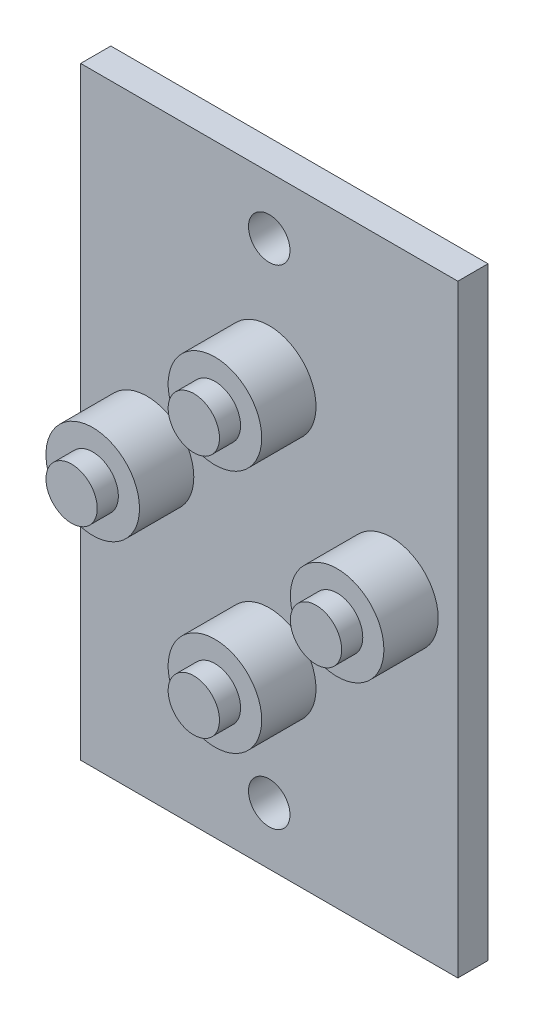
ISO-10303-21;
HEADER;
FILE_DESCRIPTION(('STEP AP214'),'2;1');
FILE_NAME('part.step','',(''),(''),'','','');
FILE_SCHEMA(('AUTOMOTIVE_DESIGN { 1 0 10303 214 1 1 1 1 }'));
ENDSEC;
DATA;
#1=APPLICATION_CONTEXT('core data for automotive mechanical design processes');
#2=APPLICATION_PROTOCOL_DEFINITION('international standard','automotive_design',2000,#1);
#3=PRODUCT_CONTEXT('',#1,'mechanical');
#4=PRODUCT('Part','Part','',(#3));
#5=PRODUCT_RELATED_PRODUCT_CATEGORY('part','',(#4));
#6=PRODUCT_DEFINITION_FORMATION('','',#4);
#7=PRODUCT_DEFINITION_CONTEXT('part definition',#1,'design');
#8=PRODUCT_DEFINITION('design','',#6,#7);
#9=PRODUCT_DEFINITION_SHAPE('','',#8);
#10=(LENGTH_UNIT() NAMED_UNIT(*) SI_UNIT(.MILLI.,.METRE.));
#11=(NAMED_UNIT(*) PLANE_ANGLE_UNIT() SI_UNIT($,.RADIAN.));
#12=(NAMED_UNIT(*) SI_UNIT($,.STERADIAN.) SOLID_ANGLE_UNIT());
#13=UNCERTAINTY_MEASURE_WITH_UNIT(LENGTH_MEASURE(1.E-05),#10,'distance_accuracy_value','');
#14=(GEOMETRIC_REPRESENTATION_CONTEXT(3) GLOBAL_UNCERTAINTY_ASSIGNED_CONTEXT((#13)) GLOBAL_UNIT_ASSIGNED_CONTEXT((#10,
#11,#12)) REPRESENTATION_CONTEXT('',''));
#15=CARTESIAN_POINT('',(0.,0.,0.));
#16=DIRECTION('',(0.,0.,1.));
#17=DIRECTION('',(1.,0.,0.));
#18=AXIS2_PLACEMENT_3D('',#15,#16,#17);
#19=CARTESIAN_POINT('',(12.5,20.,2.));
#20=DIRECTION('',(-1.,0.,0.));
#21=DIRECTION('',(0.,-1.,0.));
#22=AXIS2_PLACEMENT_3D('',#19,#20,#21);
#23=PLANE('',#22);
#24=DIRECTION('',(0.,1.,0.));
#25=VECTOR('',#24,1.);
#26=CARTESIAN_POINT('',(12.5,20.,0.));
#27=LINE('',#26,#25);
#28=CARTESIAN_POINT('',(12.5,-20.,0.));
#29=VERTEX_POINT('',#28);
#30=CARTESIAN_POINT('',(12.5,20.,0.));
#31=VERTEX_POINT('',#30);
#32=EDGE_CURVE('E98',#29,#31,#27,.T.);
#33=ORIENTED_EDGE('',*,*,#32,.T.);
#34=DIRECTION('',(0.,0.,-1.));
#35=VECTOR('',#34,1.);
#36=CARTESIAN_POINT('',(12.5,20.,2.));
#37=LINE('',#36,#35);
#38=CARTESIAN_POINT('',(12.5,20.,2.));
#39=VERTEX_POINT('',#38);
#40=EDGE_CURVE('E11',#39,#31,#37,.T.);
#41=ORIENTED_EDGE('',*,*,#40,.F.);
#42=DIRECTION('',(0.,1.,0.));
#43=VECTOR('',#42,1.);
#44=CARTESIAN_POINT('',(12.5,20.,2.));
#45=LINE('',#44,#43);
#46=CARTESIAN_POINT('',(12.5,-20.,2.));
#47=VERTEX_POINT('',#46);
#48=EDGE_CURVE('E85',#47,#39,#45,.T.);
#49=ORIENTED_EDGE('',*,*,#48,.F.);
#50=DIRECTION('',(0.,0.,-1.));
#51=VECTOR('',#50,1.);
#52=CARTESIAN_POINT('',(12.5,-20.,2.));
#53=LINE('',#52,#51);
#54=EDGE_CURVE('E94',#47,#29,#53,.T.);
#55=ORIENTED_EDGE('',*,*,#54,.T.);
#56=EDGE_LOOP('',(#33,#41,#49,#55));
#57=FACE_BOUND('',#56,.T.);
#58=ADVANCED_FACE('F32',(#57),#23,.F.);
#59=CARTESIAN_POINT('',(-12.5,20.,2.));
#60=DIRECTION('',(0.,-1.,0.));
#61=DIRECTION('',(0.,0.,-1.));
#62=AXIS2_PLACEMENT_3D('',#59,#60,#61);
#63=PLANE('',#62);
#64=DIRECTION('',(-1.,0.,0.));
#65=VECTOR('',#64,1.);
#66=CARTESIAN_POINT('',(-12.5,20.,0.));
#67=LINE('',#66,#65);
#68=CARTESIAN_POINT('',(-12.5,20.,0.));
#69=VERTEX_POINT('',#68);
#70=EDGE_CURVE('E89',#31,#69,#67,.T.);
#71=ORIENTED_EDGE('',*,*,#70,.T.);
#72=DIRECTION('',(0.,0.,-1.));
#73=VECTOR('',#72,1.);
#74=CARTESIAN_POINT('',(-12.5,20.,2.));
#75=LINE('',#74,#73);
#76=CARTESIAN_POINT('',(-12.5,20.,2.));
#77=VERTEX_POINT('',#76);
#78=EDGE_CURVE('E41',#77,#69,#75,.T.);
#79=ORIENTED_EDGE('',*,*,#78,.F.);
#80=DIRECTION('',(-1.,0.,0.));
#81=VECTOR('',#80,1.);
#82=CARTESIAN_POINT('',(-12.5,20.,2.));
#83=LINE('',#82,#81);
#84=EDGE_CURVE('E80',#39,#77,#83,.T.);
#85=ORIENTED_EDGE('',*,*,#84,.F.);
#86=ORIENTED_EDGE('',*,*,#40,.T.);
#87=EDGE_LOOP('',(#71,#79,#85,#86));
#88=FACE_BOUND('',#87,.T.);
#89=ADVANCED_FACE('F88',(#88),#63,.F.);
#90=CARTESIAN_POINT('',(-12.5,20.,2.));
#91=DIRECTION('',(1.,0.,0.));
#92=DIRECTION('',(0.,1.,0.));
#93=AXIS2_PLACEMENT_3D('',#90,#91,#92);
#94=PLANE('',#93);
#95=DIRECTION('',(0.,-1.,0.));
#96=VECTOR('',#95,1.);
#97=CARTESIAN_POINT('',(-12.5,20.,0.));
#98=LINE('',#97,#96);
#99=CARTESIAN_POINT('',(-12.5,-20.,0.));
#100=VERTEX_POINT('',#99);
#101=EDGE_CURVE('E67',#69,#100,#98,.T.);
#102=ORIENTED_EDGE('',*,*,#101,.T.);
#103=DIRECTION('',(0.,0.,-1.));
#104=VECTOR('',#103,1.);
#105=CARTESIAN_POINT('',(-12.5,-20.,2.));
#106=LINE('',#105,#104);
#107=CARTESIAN_POINT('',(-12.5,-20.,2.));
#108=VERTEX_POINT('',#107);
#109=EDGE_CURVE('E90',#108,#100,#106,.T.);
#110=ORIENTED_EDGE('',*,*,#109,.F.);
#111=DIRECTION('',(0.,-1.,0.));
#112=VECTOR('',#111,1.);
#113=CARTESIAN_POINT('',(-12.5,20.,2.));
#114=LINE('',#113,#112);
#115=EDGE_CURVE('E83',#77,#108,#114,.T.);
#116=ORIENTED_EDGE('',*,*,#115,.F.);
#117=ORIENTED_EDGE('',*,*,#78,.T.);
#118=EDGE_LOOP('',(#102,#110,#116,#117));
#119=FACE_BOUND('',#118,.T.);
#120=ADVANCED_FACE('F92',(#119),#94,.F.);
#121=CARTESIAN_POINT('',(-12.5,-20.,2.));
#122=DIRECTION('',(0.,1.,0.));
#123=DIRECTION('',(0.,0.,1.));
#124=AXIS2_PLACEMENT_3D('',#121,#122,#123);
#125=PLANE('',#124);
#126=DIRECTION('',(1.,0.,0.));
#127=VECTOR('',#126,1.);
#128=CARTESIAN_POINT('',(-12.5,-20.,0.));
#129=LINE('',#128,#127);
#130=EDGE_CURVE('E73',#100,#29,#129,.T.);
#131=ORIENTED_EDGE('',*,*,#130,.T.);
#132=ORIENTED_EDGE('',*,*,#54,.F.);
#133=DIRECTION('',(1.,0.,0.));
#134=VECTOR('',#133,1.);
#135=CARTESIAN_POINT('',(-12.5,-20.,2.));
#136=LINE('',#135,#134);
#137=EDGE_CURVE('E50',#108,#47,#136,.T.);
#138=ORIENTED_EDGE('',*,*,#137,.F.);
#139=ORIENTED_EDGE('',*,*,#109,.T.);
#140=EDGE_LOOP('',(#131,#132,#138,#139));
#141=FACE_BOUND('',#140,.T.);
#142=ADVANCED_FACE('F171',(#141),#125,.F.);
#143=CARTESIAN_POINT('',(0.,0.,2.));
#144=DIRECTION('',(0.,0.,1.));
#145=DIRECTION('',(1.,0.,0.));
#146=AXIS2_PLACEMENT_3D('',#143,#144,#145);
#147=PLANE('',#146);
#148=CARTESIAN_POINT('',(0.,-16.2,2.));
#149=DIRECTION('',(0.,0.,1.));
#150=DIRECTION('',(1.,0.,0.));
#151=AXIS2_PLACEMENT_3D('',#148,#149,#150);
#152=CIRCLE('',#151,1.375);
#153=CARTESIAN_POINT('',(1.375,-16.2,2.));
#154=VERTEX_POINT('',#153);
#155=EDGE_CURVE('E120',#154,#154,#152,.T.);
#156=ORIENTED_EDGE('',*,*,#155,.F.);
#157=EDGE_LOOP('',(#156));
#158=FACE_BOUND('',#157,.T.);
#159=CARTESIAN_POINT('',(0.,16.2,2.));
#160=DIRECTION('',(0.,0.,1.));
#161=DIRECTION('',(1.,0.,0.));
#162=AXIS2_PLACEMENT_3D('',#159,#160,#161);
#163=CIRCLE('',#162,1.375);
#164=CARTESIAN_POINT('',(1.375,16.2,2.));
#165=VERTEX_POINT('',#164);
#166=EDGE_CURVE('E109',#165,#165,#163,.T.);
#167=ORIENTED_EDGE('',*,*,#166,.F.);
#168=EDGE_LOOP('',(#167));
#169=FACE_BOUND('',#168,.T.);
#170=CARTESIAN_POINT('',(0.,-8.10000000000001,2.));
#171=DIRECTION('',(0.,0.,1.));
#172=DIRECTION('',(1.,0.,0.));
#173=AXIS2_PLACEMENT_3D('',#170,#171,#172);
#174=CIRCLE('',#173,3.1);
#175=CARTESIAN_POINT('',(3.1,-8.10000000000001,2.));
#176=VERTEX_POINT('',#175);
#177=EDGE_CURVE('E141',#176,#176,#174,.T.);
#178=ORIENTED_EDGE('',*,*,#177,.F.);
#179=EDGE_LOOP('',(#178));
#180=FACE_BOUND('',#179,.T.);
#181=CARTESIAN_POINT('',(0.,8.09999999999999,2.));
#182=DIRECTION('',(0.,0.,1.));
#183=DIRECTION('',(1.,0.,0.));
#184=AXIS2_PLACEMENT_3D('',#181,#182,#183);
#185=CIRCLE('',#184,3.1);
#186=CARTESIAN_POINT('',(3.09999999999999,8.09999999999999,2.));
#187=VERTEX_POINT('',#186);
#188=EDGE_CURVE('E147',#187,#187,#185,.T.);
#189=ORIENTED_EDGE('',*,*,#188,.F.);
#190=EDGE_LOOP('',(#189));
#191=FACE_BOUND('',#190,.T.);
#192=CARTESIAN_POINT('',(8.1,0.,2.));
#193=DIRECTION('',(0.,0.,1.));
#194=DIRECTION('',(1.,0.,0.));
#195=AXIS2_PLACEMENT_3D('',#192,#193,#194);
#196=CIRCLE('',#195,3.1);
#197=CARTESIAN_POINT('',(11.2,0.,2.));
#198=VERTEX_POINT('',#197);
#199=EDGE_CURVE('E153',#198,#198,#196,.T.);
#200=ORIENTED_EDGE('',*,*,#199,.F.);
#201=EDGE_LOOP('',(#200));
#202=FACE_BOUND('',#201,.T.);
#203=CARTESIAN_POINT('',(-8.1,0.,2.));
#204=DIRECTION('',(0.,0.,1.));
#205=DIRECTION('',(1.,0.,0.));
#206=AXIS2_PLACEMENT_3D('',#203,#204,#205);
#207=CIRCLE('',#206,3.1);
#208=CARTESIAN_POINT('',(-5.,0.,2.));
#209=VERTEX_POINT('',#208);
#210=EDGE_CURVE('E159',#209,#209,#207,.T.);
#211=ORIENTED_EDGE('',*,*,#210,.F.);
#212=EDGE_LOOP('',(#211));
#213=FACE_BOUND('',#212,.T.);
#214=ORIENTED_EDGE('',*,*,#48,.T.);
#215=ORIENTED_EDGE('',*,*,#84,.T.);
#216=ORIENTED_EDGE('',*,*,#115,.T.);
#217=ORIENTED_EDGE('',*,*,#137,.T.);
#218=EDGE_LOOP('',(#214,#215,#216,#217));
#219=FACE_BOUND('',#218,.T.);
#220=ADVANCED_FACE('F81',(#158,#169,#180,#191,#202,#213,#219),#147,.T.);
#221=CARTESIAN_POINT('',(0.,0.,0.));
#222=DIRECTION('',(0.,0.,1.));
#223=DIRECTION('',(1.,0.,0.));
#224=AXIS2_PLACEMENT_3D('',#221,#222,#223);
#225=PLANE('',#224);
#226=CARTESIAN_POINT('',(0.,-16.2,0.));
#227=DIRECTION('',(0.,0.,1.));
#228=DIRECTION('',(1.,0.,0.));
#229=AXIS2_PLACEMENT_3D('',#226,#227,#228);
#230=CIRCLE('',#229,1.375);
#231=CARTESIAN_POINT('',(1.375,-16.2,0.));
#232=VERTEX_POINT('',#231);
#233=EDGE_CURVE('E35',#232,#232,#230,.T.);
#234=ORIENTED_EDGE('',*,*,#233,.T.);
#235=EDGE_LOOP('',(#234));
#236=FACE_BOUND('',#235,.T.);
#237=CARTESIAN_POINT('',(0.,16.2,0.));
#238=DIRECTION('',(0.,0.,1.));
#239=DIRECTION('',(1.,0.,0.));
#240=AXIS2_PLACEMENT_3D('',#237,#238,#239);
#241=CIRCLE('',#240,1.375);
#242=CARTESIAN_POINT('',(1.375,16.2,0.));
#243=VERTEX_POINT('',#242);
#244=EDGE_CURVE('E106',#243,#243,#241,.T.);
#245=ORIENTED_EDGE('',*,*,#244,.T.);
#246=EDGE_LOOP('',(#245));
#247=FACE_BOUND('',#246,.T.);
#248=ORIENTED_EDGE('',*,*,#32,.F.);
#249=ORIENTED_EDGE('',*,*,#130,.F.);
#250=ORIENTED_EDGE('',*,*,#101,.F.);
#251=ORIENTED_EDGE('',*,*,#70,.F.);
#252=EDGE_LOOP('',(#248,#249,#250,#251));
#253=FACE_BOUND('',#252,.T.);
#254=ADVANCED_FACE('F170',(#236,#247,#253),#225,.F.);
#255=CARTESIAN_POINT('',(-8.1,0.,5.6));
#256=DIRECTION('',(0.,0.,-1.));
#257=DIRECTION('',(-1.,0.,0.));
#258=AXIS2_PLACEMENT_3D('',#255,#256,#257);
#259=CYLINDRICAL_SURFACE('',#258,3.1);
#260=CARTESIAN_POINT('',(-8.1,0.,5.6));
#261=DIRECTION('',(0.,0.,1.));
#262=DIRECTION('',(1.,0.,0.));
#263=AXIS2_PLACEMENT_3D('',#260,#261,#262);
#264=CIRCLE('',#263,3.1);
#265=CARTESIAN_POINT('',(-5.,0.,5.6));
#266=VERTEX_POINT('',#265);
#267=EDGE_CURVE('E101',#266,#266,#264,.T.);
#268=ORIENTED_EDGE('',*,*,#267,.F.);
#269=EDGE_LOOP('',(#268));
#270=FACE_BOUND('',#269,.T.);
#271=ORIENTED_EDGE('',*,*,#210,.T.);
#272=EDGE_LOOP('',(#271));
#273=FACE_BOUND('',#272,.T.);
#274=ADVANCED_FACE('F167',(#270,#273),#259,.T.);
#275=CARTESIAN_POINT('',(-8.1,0.,5.6));
#276=DIRECTION('',(0.,0.,1.));
#277=DIRECTION('',(1.,0.,0.));
#278=AXIS2_PLACEMENT_3D('',#275,#276,#277);
#279=PLANE('',#278);
#280=CARTESIAN_POINT('',(-8.1,0.,5.6));
#281=DIRECTION('',(0.,0.,1.));
#282=DIRECTION('',(1.,0.,0.));
#283=AXIS2_PLACEMENT_3D('',#280,#281,#282);
#284=CIRCLE('',#283,1.7);
#285=CARTESIAN_POINT('',(-6.4,0.,5.6));
#286=VERTEX_POINT('',#285);
#287=EDGE_CURVE('E129',#286,#286,#284,.T.);
#288=ORIENTED_EDGE('',*,*,#287,.F.);
#289=EDGE_LOOP('',(#288));
#290=FACE_BOUND('',#289,.T.);
#291=ORIENTED_EDGE('',*,*,#267,.T.);
#292=EDGE_LOOP('',(#291));
#293=FACE_BOUND('',#292,.T.);
#294=ADVANCED_FACE('F211',(#290,#293),#279,.T.);
#295=CARTESIAN_POINT('',(8.1,0.,5.6));
#296=DIRECTION('',(0.,0.,-1.));
#297=DIRECTION('',(-1.,0.,0.));
#298=AXIS2_PLACEMENT_3D('',#295,#296,#297);
#299=CYLINDRICAL_SURFACE('',#298,3.1);
#300=CARTESIAN_POINT('',(8.1,0.,5.6));
#301=DIRECTION('',(0.,0.,1.));
#302=DIRECTION('',(1.,0.,0.));
#303=AXIS2_PLACEMENT_3D('',#300,#301,#302);
#304=CIRCLE('',#303,3.1);
#305=CARTESIAN_POINT('',(11.2,0.,5.6));
#306=VERTEX_POINT('',#305);
#307=EDGE_CURVE('E156',#306,#306,#304,.T.);
#308=ORIENTED_EDGE('',*,*,#307,.F.);
#309=EDGE_LOOP('',(#308));
#310=FACE_BOUND('',#309,.T.);
#311=ORIENTED_EDGE('',*,*,#199,.T.);
#312=EDGE_LOOP('',(#311));
#313=FACE_BOUND('',#312,.T.);
#314=ADVANCED_FACE('F219',(#310,#313),#299,.T.);
#315=CARTESIAN_POINT('',(8.1,0.,5.6));
#316=DIRECTION('',(0.,0.,1.));
#317=DIRECTION('',(1.,0.,0.));
#318=AXIS2_PLACEMENT_3D('',#315,#316,#317);
#319=PLANE('',#318);
#320=CARTESIAN_POINT('',(8.1,0.,5.6));
#321=DIRECTION('',(0.,0.,1.));
#322=DIRECTION('',(1.,0.,0.));
#323=AXIS2_PLACEMENT_3D('',#320,#321,#322);
#324=CIRCLE('',#323,1.7);
#325=CARTESIAN_POINT('',(9.8,0.,5.6));
#326=VERTEX_POINT('',#325);
#327=EDGE_CURVE('E124',#326,#326,#324,.T.);
#328=ORIENTED_EDGE('',*,*,#327,.F.);
#329=EDGE_LOOP('',(#328));
#330=FACE_BOUND('',#329,.T.);
#331=ORIENTED_EDGE('',*,*,#307,.T.);
#332=EDGE_LOOP('',(#331));
#333=FACE_BOUND('',#332,.T.);
#334=ADVANCED_FACE('F224',(#330,#333),#319,.T.);
#335=CARTESIAN_POINT('',(0.,8.09999999999999,5.6));
#336=DIRECTION('',(0.,0.,-1.));
#337=DIRECTION('',(-1.,0.,0.));
#338=AXIS2_PLACEMENT_3D('',#335,#336,#337);
#339=CYLINDRICAL_SURFACE('',#338,3.1);
#340=CARTESIAN_POINT('',(0.,8.09999999999999,5.6));
#341=DIRECTION('',(0.,0.,1.));
#342=DIRECTION('',(1.,0.,0.));
#343=AXIS2_PLACEMENT_3D('',#340,#341,#342);
#344=CIRCLE('',#343,3.1);
#345=CARTESIAN_POINT('',(3.09999999999999,8.09999999999999,5.6));
#346=VERTEX_POINT('',#345);
#347=EDGE_CURVE('E150',#346,#346,#344,.T.);
#348=ORIENTED_EDGE('',*,*,#347,.F.);
#349=EDGE_LOOP('',(#348));
#350=FACE_BOUND('',#349,.T.);
#351=ORIENTED_EDGE('',*,*,#188,.T.);
#352=EDGE_LOOP('',(#351));
#353=FACE_BOUND('',#352,.T.);
#354=ADVANCED_FACE('F232',(#350,#353),#339,.T.);
#355=CARTESIAN_POINT('',(0.,8.09999999999999,5.6));
#356=DIRECTION('',(0.,0.,1.));
#357=DIRECTION('',(1.,0.,0.));
#358=AXIS2_PLACEMENT_3D('',#355,#356,#357);
#359=PLANE('',#358);
#360=CARTESIAN_POINT('',(0.,8.1,5.6));
#361=DIRECTION('',(0.,0.,1.));
#362=DIRECTION('',(1.,0.,0.));
#363=AXIS2_PLACEMENT_3D('',#360,#361,#362);
#364=CIRCLE('',#363,1.7);
#365=CARTESIAN_POINT('',(1.7,8.1,5.6));
#366=VERTEX_POINT('',#365);
#367=EDGE_CURVE('E135',#366,#366,#364,.T.);
#368=ORIENTED_EDGE('',*,*,#367,.F.);
#369=EDGE_LOOP('',(#368));
#370=FACE_BOUND('',#369,.T.);
#371=ORIENTED_EDGE('',*,*,#347,.T.);
#372=EDGE_LOOP('',(#371));
#373=FACE_BOUND('',#372,.T.);
#374=ADVANCED_FACE('F237',(#370,#373),#359,.T.);
#375=CARTESIAN_POINT('',(0.,-8.10000000000001,5.6));
#376=DIRECTION('',(0.,0.,-1.));
#377=DIRECTION('',(-1.,0.,0.));
#378=AXIS2_PLACEMENT_3D('',#375,#376,#377);
#379=CYLINDRICAL_SURFACE('',#378,3.1);
#380=CARTESIAN_POINT('',(0.,-8.10000000000001,5.6));
#381=DIRECTION('',(0.,0.,1.));
#382=DIRECTION('',(1.,0.,0.));
#383=AXIS2_PLACEMENT_3D('',#380,#381,#382);
#384=CIRCLE('',#383,3.1);
#385=CARTESIAN_POINT('',(3.1,-8.10000000000001,5.6));
#386=VERTEX_POINT('',#385);
#387=EDGE_CURVE('E144',#386,#386,#384,.T.);
#388=ORIENTED_EDGE('',*,*,#387,.F.);
#389=EDGE_LOOP('',(#388));
#390=FACE_BOUND('',#389,.T.);
#391=ORIENTED_EDGE('',*,*,#177,.T.);
#392=EDGE_LOOP('',(#391));
#393=FACE_BOUND('',#392,.T.);
#394=ADVANCED_FACE('F245',(#390,#393),#379,.T.);
#395=CARTESIAN_POINT('',(0.,-8.10000000000001,5.6));
#396=DIRECTION('',(0.,0.,1.));
#397=DIRECTION('',(1.,0.,0.));
#398=AXIS2_PLACEMENT_3D('',#395,#396,#397);
#399=PLANE('',#398);
#400=CARTESIAN_POINT('',(0.,-8.1,5.6));
#401=DIRECTION('',(0.,0.,1.));
#402=DIRECTION('',(1.,0.,0.));
#403=AXIS2_PLACEMENT_3D('',#400,#401,#402);
#404=CIRCLE('',#403,1.7);
#405=CARTESIAN_POINT('',(1.7,-8.1,5.6));
#406=VERTEX_POINT('',#405);
#407=EDGE_CURVE('E108',#406,#406,#404,.T.);
#408=ORIENTED_EDGE('',*,*,#407,.F.);
#409=EDGE_LOOP('',(#408));
#410=FACE_BOUND('',#409,.T.);
#411=ORIENTED_EDGE('',*,*,#387,.T.);
#412=EDGE_LOOP('',(#411));
#413=FACE_BOUND('',#412,.T.);
#414=ADVANCED_FACE('F250',(#410,#413),#399,.T.);
#415=CARTESIAN_POINT('',(0.,8.1,7.));
#416=DIRECTION('',(0.,0.,-1.));
#417=DIRECTION('',(-1.,0.,0.));
#418=AXIS2_PLACEMENT_3D('',#415,#416,#417);
#419=CYLINDRICAL_SURFACE('',#418,1.7);
#420=CARTESIAN_POINT('',(0.,8.1,7.));
#421=DIRECTION('',(0.,0.,1.));
#422=DIRECTION('',(1.,0.,0.));
#423=AXIS2_PLACEMENT_3D('',#420,#421,#422);
#424=CIRCLE('',#423,1.7);
#425=CARTESIAN_POINT('',(1.7,8.1,7.));
#426=VERTEX_POINT('',#425);
#427=EDGE_CURVE('E138',#426,#426,#424,.T.);
#428=ORIENTED_EDGE('',*,*,#427,.F.);
#429=EDGE_LOOP('',(#428));
#430=FACE_BOUND('',#429,.T.);
#431=ORIENTED_EDGE('',*,*,#367,.T.);
#432=EDGE_LOOP('',(#431));
#433=FACE_BOUND('',#432,.T.);
#434=ADVANCED_FACE('F265',(#430,#433),#419,.T.);
#435=CARTESIAN_POINT('',(0.,8.1,7.));
#436=DIRECTION('',(0.,0.,1.));
#437=DIRECTION('',(1.,0.,0.));
#438=AXIS2_PLACEMENT_3D('',#435,#436,#437);
#439=PLANE('',#438);
#440=ORIENTED_EDGE('',*,*,#427,.T.);
#441=EDGE_LOOP('',(#440));
#442=FACE_BOUND('',#441,.T.);
#443=ADVANCED_FACE('F270',(#442),#439,.T.);
#444=CARTESIAN_POINT('',(-8.1,0.,7.));
#445=DIRECTION('',(0.,0.,-1.));
#446=DIRECTION('',(-1.,0.,0.));
#447=AXIS2_PLACEMENT_3D('',#444,#445,#446);
#448=CYLINDRICAL_SURFACE('',#447,1.7);
#449=CARTESIAN_POINT('',(-8.1,0.,7.));
#450=DIRECTION('',(0.,0.,1.));
#451=DIRECTION('',(1.,0.,0.));
#452=AXIS2_PLACEMENT_3D('',#449,#450,#451);
#453=CIRCLE('',#452,1.7);
#454=CARTESIAN_POINT('',(-6.4,0.,7.));
#455=VERTEX_POINT('',#454);
#456=EDGE_CURVE('E132',#455,#455,#453,.T.);
#457=ORIENTED_EDGE('',*,*,#456,.F.);
#458=EDGE_LOOP('',(#457));
#459=FACE_BOUND('',#458,.T.);
#460=ORIENTED_EDGE('',*,*,#287,.T.);
#461=EDGE_LOOP('',(#460));
#462=FACE_BOUND('',#461,.T.);
#463=ADVANCED_FACE('F280',(#459,#462),#448,.T.);
#464=CARTESIAN_POINT('',(-8.1,0.,7.));
#465=DIRECTION('',(0.,0.,1.));
#466=DIRECTION('',(1.,0.,0.));
#467=AXIS2_PLACEMENT_3D('',#464,#465,#466);
#468=PLANE('',#467);
#469=ORIENTED_EDGE('',*,*,#456,.T.);
#470=EDGE_LOOP('',(#469));
#471=FACE_BOUND('',#470,.T.);
#472=ADVANCED_FACE('F297',(#471),#468,.T.);
#473=CARTESIAN_POINT('',(8.1,0.,7.));
#474=DIRECTION('',(0.,0.,-1.));
#475=DIRECTION('',(-1.,0.,0.));
#476=AXIS2_PLACEMENT_3D('',#473,#474,#475);
#477=CYLINDRICAL_SURFACE('',#476,1.7);
#478=CARTESIAN_POINT('',(8.1,0.,7.));
#479=DIRECTION('',(0.,0.,1.));
#480=DIRECTION('',(1.,0.,0.));
#481=AXIS2_PLACEMENT_3D('',#478,#479,#480);
#482=CIRCLE('',#481,1.7);
#483=CARTESIAN_POINT('',(9.8,0.,7.));
#484=VERTEX_POINT('',#483);
#485=EDGE_CURVE('E126',#484,#484,#482,.T.);
#486=ORIENTED_EDGE('',*,*,#485,.F.);
#487=EDGE_LOOP('',(#486));
#488=FACE_BOUND('',#487,.T.);
#489=ORIENTED_EDGE('',*,*,#327,.T.);
#490=EDGE_LOOP('',(#489));
#491=FACE_BOUND('',#490,.T.);
#492=ADVANCED_FACE('F307',(#488,#491),#477,.T.);
#493=CARTESIAN_POINT('',(8.1,0.,7.));
#494=DIRECTION('',(0.,0.,1.));
#495=DIRECTION('',(1.,0.,0.));
#496=AXIS2_PLACEMENT_3D('',#493,#494,#495);
#497=PLANE('',#496);
#498=ORIENTED_EDGE('',*,*,#485,.T.);
#499=EDGE_LOOP('',(#498));
#500=FACE_BOUND('',#499,.T.);
#501=ADVANCED_FACE('F324',(#500),#497,.T.);
#502=CARTESIAN_POINT('',(0.,-8.1,7.));
#503=DIRECTION('',(0.,0.,-1.));
#504=DIRECTION('',(-1.,0.,0.));
#505=AXIS2_PLACEMENT_3D('',#502,#503,#504);
#506=CYLINDRICAL_SURFACE('',#505,1.7);
#507=CARTESIAN_POINT('',(0.,-8.1,7.));
#508=DIRECTION('',(0.,0.,1.));
#509=DIRECTION('',(1.,0.,0.));
#510=AXIS2_PLACEMENT_3D('',#507,#508,#509);
#511=CIRCLE('',#510,1.7);
#512=CARTESIAN_POINT('',(1.7,-8.1,7.));
#513=VERTEX_POINT('',#512);
#514=EDGE_CURVE('E113',#513,#513,#511,.T.);
#515=ORIENTED_EDGE('',*,*,#514,.F.);
#516=EDGE_LOOP('',(#515));
#517=FACE_BOUND('',#516,.T.);
#518=ORIENTED_EDGE('',*,*,#407,.T.);
#519=EDGE_LOOP('',(#518));
#520=FACE_BOUND('',#519,.T.);
#521=ADVANCED_FACE('F334',(#517,#520),#506,.T.);
#522=CARTESIAN_POINT('',(0.,-8.1,7.));
#523=DIRECTION('',(0.,0.,1.));
#524=DIRECTION('',(1.,0.,0.));
#525=AXIS2_PLACEMENT_3D('',#522,#523,#524);
#526=PLANE('',#525);
#527=ORIENTED_EDGE('',*,*,#514,.T.);
#528=EDGE_LOOP('',(#527));
#529=FACE_BOUND('',#528,.T.);
#530=ADVANCED_FACE('F351',(#529),#526,.T.);
#531=CARTESIAN_POINT('',(0.,16.2,-1.));
#532=DIRECTION('',(0.,0.,1.));
#533=DIRECTION('',(1.,0.,0.));
#534=AXIS2_PLACEMENT_3D('',#531,#532,#533);
#535=CYLINDRICAL_SURFACE('',#534,1.375);
#536=ORIENTED_EDGE('',*,*,#166,.T.);
#537=EDGE_LOOP('',(#536));
#538=FACE_BOUND('',#537,.T.);
#539=ORIENTED_EDGE('',*,*,#244,.F.);
#540=EDGE_LOOP('',(#539));
#541=FACE_BOUND('',#540,.T.);
#542=ADVANCED_FACE('F360',(#538,#541),#535,.F.);
#543=CARTESIAN_POINT('',(0.,-16.2,-1.));
#544=DIRECTION('',(0.,0.,1.));
#545=DIRECTION('',(1.,0.,0.));
#546=AXIS2_PLACEMENT_3D('',#543,#544,#545);
#547=CYLINDRICAL_SURFACE('',#546,1.375);
#548=ORIENTED_EDGE('',*,*,#155,.T.);
#549=EDGE_LOOP('',(#548));
#550=FACE_BOUND('',#549,.T.);
#551=ORIENTED_EDGE('',*,*,#233,.F.);
#552=EDGE_LOOP('',(#551));
#553=FACE_BOUND('',#552,.T.);
#554=ADVANCED_FACE('F379',(#550,#553),#547,.F.);
#555=CLOSED_SHELL('',(#58,#89,#120,#142,#220,#254,#274,#294,#314,#334,#354,#374,#394,#414,#434,
#443,#463,#472,#492,#501,#521,#530,#542,#554));
#556=MANIFOLD_SOLID_BREP('B2',#555);
#557=ADVANCED_BREP_SHAPE_REPRESENTATION('',(#18,#556),#14);
#558=SHAPE_DEFINITION_REPRESENTATION(#9,#557);
ENDSEC;
END-ISO-10303-21;
